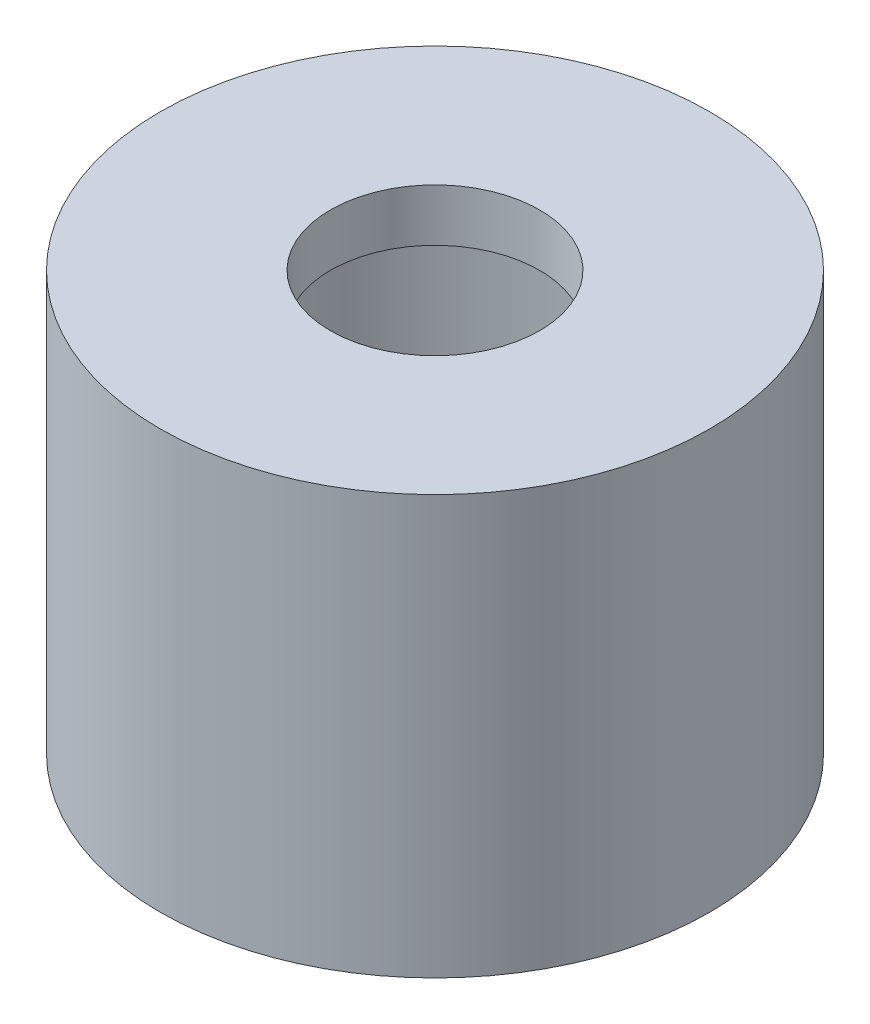
ISO-10303-21;
HEADER;
FILE_DESCRIPTION(('STEP AP214'),'2;1');
FILE_NAME('part.step','',(''),(''),'','','');
FILE_SCHEMA(('AUTOMOTIVE_DESIGN { 1 0 10303 214 1 1 1 1 }'));
ENDSEC;
DATA;
#1=APPLICATION_CONTEXT('core data for automotive mechanical design processes');
#2=APPLICATION_PROTOCOL_DEFINITION('international standard','automotive_design',2000,#1);
#3=PRODUCT_CONTEXT('',#1,'mechanical');
#4=PRODUCT('Part','Part','',(#3));
#5=PRODUCT_RELATED_PRODUCT_CATEGORY('part','',(#4));
#6=PRODUCT_DEFINITION_FORMATION('','',#4);
#7=PRODUCT_DEFINITION_CONTEXT('part definition',#1,'design');
#8=PRODUCT_DEFINITION('design','',#6,#7);
#9=PRODUCT_DEFINITION_SHAPE('','',#8);
#10=(LENGTH_UNIT() NAMED_UNIT(*) SI_UNIT(.MILLI.,.METRE.));
#11=(NAMED_UNIT(*) PLANE_ANGLE_UNIT() SI_UNIT($,.RADIAN.));
#12=(NAMED_UNIT(*) SI_UNIT($,.STERADIAN.) SOLID_ANGLE_UNIT());
#13=UNCERTAINTY_MEASURE_WITH_UNIT(LENGTH_MEASURE(1.E-05),#10,'distance_accuracy_value','');
#14=(GEOMETRIC_REPRESENTATION_CONTEXT(3) GLOBAL_UNCERTAINTY_ASSIGNED_CONTEXT((#13)) GLOBAL_UNIT_ASSIGNED_CONTEXT((#10,
#11,#12)) REPRESENTATION_CONTEXT('',''));
#15=CARTESIAN_POINT('',(0.,0.,0.));
#16=DIRECTION('',(0.,0.,1.));
#17=DIRECTION('',(1.,0.,0.));
#18=AXIS2_PLACEMENT_3D('',#15,#16,#17);
#19=CARTESIAN_POINT('',(0.,0.,0.));
#20=DIRECTION('',(0.,1.,0.));
#21=DIRECTION('',(0.,0.,1.));
#22=AXIS2_PLACEMENT_3D('',#19,#20,#21);
#23=CYLINDRICAL_SURFACE('',#22,10.5);
#24=CARTESIAN_POINT('',(0.,-19.,0.));
#25=DIRECTION('',(0.,1.,0.));
#26=DIRECTION('',(0.,0.,1.));
#27=AXIS2_PLACEMENT_3D('',#24,#25,#26);
#28=CIRCLE('',#27,10.5);
#29=CARTESIAN_POINT('',(0.,-19.,10.5));
#30=VERTEX_POINT('',#29);
#31=EDGE_CURVE('E10',#30,#30,#28,.T.);
#32=ORIENTED_EDGE('',*,*,#31,.T.);
#33=EDGE_LOOP('',(#32));
#34=FACE_BOUND('',#33,.T.);
#35=CARTESIAN_POINT('',(0.,-3.,0.));
#36=DIRECTION('',(0.,1.,0.));
#37=DIRECTION('',(0.,0.,1.));
#38=AXIS2_PLACEMENT_3D('',#35,#36,#37);
#39=CIRCLE('',#38,10.5);
#40=CARTESIAN_POINT('',(0.,-3.,10.5));
#41=VERTEX_POINT('',#40);
#42=EDGE_CURVE('E51',#41,#41,#39,.T.);
#43=ORIENTED_EDGE('',*,*,#42,.F.);
#44=EDGE_LOOP('',(#43));
#45=FACE_BOUND('',#44,.T.);
#46=ADVANCED_FACE('F29',(#34,#45),#23,.T.);
#47=CARTESIAN_POINT('',(-10.5,-19.,0.));
#48=DIRECTION('',(0.,-1.,0.));
#49=DIRECTION('',(0.,0.,-1.));
#50=AXIS2_PLACEMENT_3D('',#47,#48,#49);
#51=PLANE('',#50);
#52=CARTESIAN_POINT('',(0.,-19.,0.));
#53=DIRECTION('',(0.,1.,0.));
#54=DIRECTION('',(0.,0.,1.));
#55=AXIS2_PLACEMENT_3D('',#52,#53,#54);
#56=CIRCLE('',#55,8.5);
#57=CARTESIAN_POINT('',(0.,-19.,8.5));
#58=VERTEX_POINT('',#57);
#59=EDGE_CURVE('E35',#58,#58,#56,.T.);
#60=ORIENTED_EDGE('',*,*,#59,.T.);
#61=EDGE_LOOP('',(#60));
#62=FACE_BOUND('',#61,.T.);
#63=ORIENTED_EDGE('',*,*,#31,.F.);
#64=EDGE_LOOP('',(#63));
#65=FACE_BOUND('',#64,.T.);
#66=ADVANCED_FACE('F59',(#62,#65),#51,.T.);
#67=CARTESIAN_POINT('',(0.,0.,0.));
#68=DIRECTION('',(0.,1.,0.));
#69=DIRECTION('',(0.,0.,1.));
#70=AXIS2_PLACEMENT_3D('',#67,#68,#69);
#71=CYLINDRICAL_SURFACE('',#70,8.5);
#72=CARTESIAN_POINT('',(0.,-5.,0.));
#73=DIRECTION('',(0.,1.,0.));
#74=DIRECTION('',(0.,0.,1.));
#75=AXIS2_PLACEMENT_3D('',#72,#73,#74);
#76=CIRCLE('',#75,8.5);
#77=CARTESIAN_POINT('',(0.,-5.,8.5));
#78=VERTEX_POINT('',#77);
#79=EDGE_CURVE('E39',#78,#78,#76,.T.);
#80=ORIENTED_EDGE('',*,*,#79,.T.);
#81=EDGE_LOOP('',(#80));
#82=FACE_BOUND('',#81,.T.);
#83=ORIENTED_EDGE('',*,*,#59,.F.);
#84=EDGE_LOOP('',(#83));
#85=FACE_BOUND('',#84,.T.);
#86=ADVANCED_FACE('F63',(#82,#85),#71,.F.);
#87=CARTESIAN_POINT('',(-8.5,-5.,0.));
#88=DIRECTION('',(0.,-1.,0.));
#89=DIRECTION('',(0.,0.,-1.));
#90=AXIS2_PLACEMENT_3D('',#87,#88,#89);
#91=PLANE('',#90);
#92=CARTESIAN_POINT('',(0.,-5.,0.));
#93=DIRECTION('',(0.,1.,0.));
#94=DIRECTION('',(0.,0.,1.));
#95=AXIS2_PLACEMENT_3D('',#92,#93,#94);
#96=CIRCLE('',#95,4.);
#97=CARTESIAN_POINT('',(0.,-5.,4.));
#98=VERTEX_POINT('',#97);
#99=EDGE_CURVE('E43',#98,#98,#96,.T.);
#100=ORIENTED_EDGE('',*,*,#99,.T.);
#101=EDGE_LOOP('',(#100));
#102=FACE_BOUND('',#101,.T.);
#103=ORIENTED_EDGE('',*,*,#79,.F.);
#104=EDGE_LOOP('',(#103));
#105=FACE_BOUND('',#104,.T.);
#106=ADVANCED_FACE('F67',(#102,#105),#91,.T.);
#107=CARTESIAN_POINT('',(0.,0.,0.));
#108=DIRECTION('',(0.,1.,0.));
#109=DIRECTION('',(0.,0.,1.));
#110=AXIS2_PLACEMENT_3D('',#107,#108,#109);
#111=CYLINDRICAL_SURFACE('',#110,4.);
#112=CARTESIAN_POINT('',(0.,-3.,0.));
#113=DIRECTION('',(0.,1.,0.));
#114=DIRECTION('',(0.,0.,1.));
#115=AXIS2_PLACEMENT_3D('',#112,#113,#114);
#116=CIRCLE('',#115,4.);
#117=CARTESIAN_POINT('',(0.,-3.,4.));
#118=VERTEX_POINT('',#117);
#119=EDGE_CURVE('E48',#118,#118,#116,.T.);
#120=ORIENTED_EDGE('',*,*,#119,.T.);
#121=EDGE_LOOP('',(#120));
#122=FACE_BOUND('',#121,.T.);
#123=ORIENTED_EDGE('',*,*,#99,.F.);
#124=EDGE_LOOP('',(#123));
#125=FACE_BOUND('',#124,.T.);
#126=ADVANCED_FACE('F74',(#122,#125),#111,.F.);
#127=CARTESIAN_POINT('',(-10.5,-3.,0.));
#128=DIRECTION('',(0.,1.,0.));
#129=DIRECTION('',(0.,0.,1.));
#130=AXIS2_PLACEMENT_3D('',#127,#128,#129);
#131=PLANE('',#130);
#132=ORIENTED_EDGE('',*,*,#42,.T.);
#133=EDGE_LOOP('',(#132));
#134=FACE_BOUND('',#133,.T.);
#135=ORIENTED_EDGE('',*,*,#119,.F.);
#136=EDGE_LOOP('',(#135));
#137=FACE_BOUND('',#136,.T.);
#138=ADVANCED_FACE('F55',(#134,#137),#131,.T.);
#139=CLOSED_SHELL('',(#46,#66,#86,#106,#126,#138));
#140=MANIFOLD_SOLID_BREP('B2',#139);
#141=ADVANCED_BREP_SHAPE_REPRESENTATION('',(#18,#140),#14);
#142=SHAPE_DEFINITION_REPRESENTATION(#9,#141);
ENDSEC;
END-ISO-10303-21;
